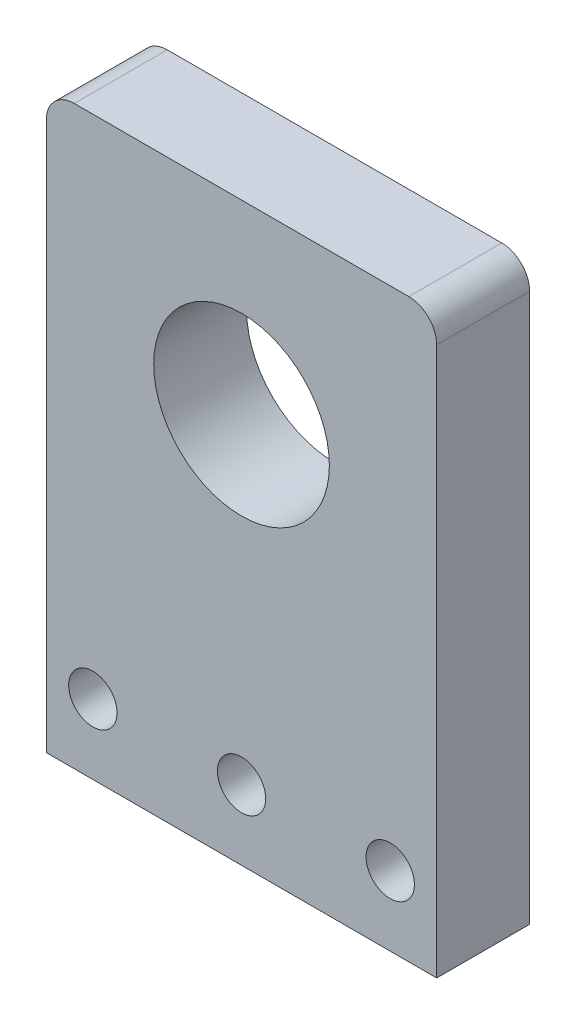
ISO-10303-21;
HEADER;
FILE_DESCRIPTION(('STEP AP214'),'2;1');
FILE_NAME('part.step','',(''),(''),'','','');
FILE_SCHEMA(('AUTOMOTIVE_DESIGN { 1 0 10303 214 1 1 1 1 }'));
ENDSEC;
DATA;
#1=APPLICATION_CONTEXT('core data for automotive mechanical design processes');
#2=APPLICATION_PROTOCOL_DEFINITION('international standard','automotive_design',2000,#1);
#3=PRODUCT_CONTEXT('',#1,'mechanical');
#4=PRODUCT('Part','Part','',(#3));
#5=PRODUCT_RELATED_PRODUCT_CATEGORY('part','',(#4));
#6=PRODUCT_DEFINITION_FORMATION('','',#4);
#7=PRODUCT_DEFINITION_CONTEXT('part definition',#1,'design');
#8=PRODUCT_DEFINITION('design','',#6,#7);
#9=PRODUCT_DEFINITION_SHAPE('','',#8);
#10=(LENGTH_UNIT() NAMED_UNIT(*) SI_UNIT(.MILLI.,.METRE.));
#11=(NAMED_UNIT(*) PLANE_ANGLE_UNIT() SI_UNIT($,.RADIAN.));
#12=(NAMED_UNIT(*) SI_UNIT($,.STERADIAN.) SOLID_ANGLE_UNIT());
#13=UNCERTAINTY_MEASURE_WITH_UNIT(LENGTH_MEASURE(1.E-05),#10,'distance_accuracy_value','');
#14=(GEOMETRIC_REPRESENTATION_CONTEXT(3) GLOBAL_UNCERTAINTY_ASSIGNED_CONTEXT((#13)) GLOBAL_UNIT_ASSIGNED_CONTEXT((#10,
#11,#12)) REPRESENTATION_CONTEXT('',''));
#15=CARTESIAN_POINT('',(0.,0.,0.));
#16=DIRECTION('',(0.,0.,1.));
#17=DIRECTION('',(1.,0.,0.));
#18=AXIS2_PLACEMENT_3D('',#15,#16,#17);
#19=CARTESIAN_POINT('',(0.,0.,10.));
#20=DIRECTION('',(0.,0.,-1.));
#21=DIRECTION('',(-1.,0.,0.));
#22=AXIS2_PLACEMENT_3D('',#19,#20,#21);
#23=PLANE('',#22);
#24=CARTESIAN_POINT('',(21.,42.,10.));
#25=DIRECTION('',(0.,0.,1.));
#26=DIRECTION('',(1.,0.,0.));
#27=AXIS2_PLACEMENT_3D('',#24,#25,#26);
#28=CIRCLE('',#27,9.45);
#29=CARTESIAN_POINT('',(30.45,42.,10.));
#30=VERTEX_POINT('',#29);
#31=EDGE_CURVE('E196',#30,#30,#28,.T.);
#32=ORIENTED_EDGE('',*,*,#31,.F.);
#33=EDGE_LOOP('',(#32));
#34=FACE_BOUND('',#33,.T.);
#35=CARTESIAN_POINT('',(4.99999999999999,7.5,10.));
#36=DIRECTION('',(0.,0.,1.));
#37=DIRECTION('',(1.,0.,0.));
#38=AXIS2_PLACEMENT_3D('',#35,#36,#37);
#39=CIRCLE('',#38,2.6);
#40=CARTESIAN_POINT('',(7.59999999999999,7.5,10.));
#41=VERTEX_POINT('',#40);
#42=EDGE_CURVE('E189',#41,#41,#39,.T.);
#43=ORIENTED_EDGE('',*,*,#42,.F.);
#44=EDGE_LOOP('',(#43));
#45=FACE_BOUND('',#44,.T.);
#46=CARTESIAN_POINT('',(21.,7.5,10.));
#47=DIRECTION('',(0.,0.,1.));
#48=DIRECTION('',(1.,0.,0.));
#49=AXIS2_PLACEMENT_3D('',#46,#47,#48);
#50=CIRCLE('',#49,2.6);
#51=CARTESIAN_POINT('',(23.6,7.5,10.));
#52=VERTEX_POINT('',#51);
#53=EDGE_CURVE('E185',#52,#52,#50,.T.);
#54=ORIENTED_EDGE('',*,*,#53,.F.);
#55=EDGE_LOOP('',(#54));
#56=FACE_BOUND('',#55,.T.);
#57=CARTESIAN_POINT('',(37.,7.5,10.));
#58=DIRECTION('',(0.,0.,1.));
#59=DIRECTION('',(1.,0.,0.));
#60=AXIS2_PLACEMENT_3D('',#57,#58,#59);
#61=CIRCLE('',#60,2.6);
#62=CARTESIAN_POINT('',(39.6,7.5,10.));
#63=VERTEX_POINT('',#62);
#64=EDGE_CURVE('E176',#63,#63,#61,.T.);
#65=ORIENTED_EDGE('',*,*,#64,.F.);
#66=EDGE_LOOP('',(#65));
#67=FACE_BOUND('',#66,.T.);
#68=DIRECTION('',(0.,1.,0.));
#69=VECTOR('',#68,1.);
#70=CARTESIAN_POINT('',(42.,0.,10.));
#71=LINE('',#70,#69);
#72=CARTESIAN_POINT('',(42.,0.,10.));
#73=VERTEX_POINT('',#72);
#74=CARTESIAN_POINT('',(42.,59.,10.));
#75=VERTEX_POINT('',#74);
#76=EDGE_CURVE('E113',#73,#75,#71,.T.);
#77=ORIENTED_EDGE('',*,*,#76,.T.);
#78=CARTESIAN_POINT('',(39.,59.,10.));
#79=DIRECTION('',(0.,0.,-1.));
#80=DIRECTION('',(-1.,0.,0.));
#81=AXIS2_PLACEMENT_3D('',#78,#79,#80);
#82=CIRCLE('',#81,3.);
#83=CARTESIAN_POINT('',(39.,62.,10.));
#84=VERTEX_POINT('',#83);
#85=EDGE_CURVE('E51',#75,#84,#82,.F.);
#86=ORIENTED_EDGE('',*,*,#85,.T.);
#87=DIRECTION('',(-1.,0.,0.));
#88=VECTOR('',#87,1.);
#89=CARTESIAN_POINT('',(0.,62.,10.));
#90=LINE('',#89,#88);
#91=CARTESIAN_POINT('',(2.99999999999999,62.,10.));
#92=VERTEX_POINT('',#91);
#93=EDGE_CURVE('E126',#84,#92,#90,.T.);
#94=ORIENTED_EDGE('',*,*,#93,.T.);
#95=CARTESIAN_POINT('',(2.99999999999999,59.,10.));
#96=DIRECTION('',(0.,0.,-1.));
#97=DIRECTION('',(-1.,0.,0.));
#98=AXIS2_PLACEMENT_3D('',#95,#96,#97);
#99=CIRCLE('',#98,3.);
#100=CARTESIAN_POINT('',(0.,59.,10.));
#101=VERTEX_POINT('',#100);
#102=EDGE_CURVE('E58',#92,#101,#99,.F.);
#103=ORIENTED_EDGE('',*,*,#102,.T.);
#104=DIRECTION('',(0.,-1.,0.));
#105=VECTOR('',#104,1.);
#106=CARTESIAN_POINT('',(0.,0.,10.));
#107=LINE('',#106,#105);
#108=CARTESIAN_POINT('',(0.,0.,10.));
#109=VERTEX_POINT('',#108);
#110=EDGE_CURVE('E96',#101,#109,#107,.T.);
#111=ORIENTED_EDGE('',*,*,#110,.T.);
#112=DIRECTION('',(1.,0.,0.));
#113=VECTOR('',#112,1.);
#114=CARTESIAN_POINT('',(0.,0.,10.));
#115=LINE('',#114,#113);
#116=EDGE_CURVE('E98',#109,#73,#115,.T.);
#117=ORIENTED_EDGE('',*,*,#116,.T.);
#118=EDGE_LOOP('',(#77,#86,#94,#103,#111,#117));
#119=FACE_BOUND('',#118,.T.);
#120=ADVANCED_FACE('F42',(#34,#45,#56,#67,#119),#23,.F.);
#121=CARTESIAN_POINT('',(0.,0.,0.));
#122=DIRECTION('',(0.,0.,-1.));
#123=DIRECTION('',(-1.,0.,0.));
#124=AXIS2_PLACEMENT_3D('',#121,#122,#123);
#125=PLANE('',#124);
#126=CARTESIAN_POINT('',(21.,42.,0.));
#127=DIRECTION('',(0.,0.,1.));
#128=DIRECTION('',(1.,0.,0.));
#129=AXIS2_PLACEMENT_3D('',#126,#127,#128);
#130=CIRCLE('',#129,9.45);
#131=CARTESIAN_POINT('',(30.45,42.,0.));
#132=VERTEX_POINT('',#131);
#133=EDGE_CURVE('E177',#132,#132,#130,.T.);
#134=ORIENTED_EDGE('',*,*,#133,.T.);
#135=EDGE_LOOP('',(#134));
#136=FACE_BOUND('',#135,.T.);
#137=CARTESIAN_POINT('',(4.99999999999999,7.5,0.));
#138=DIRECTION('',(0.,0.,1.));
#139=DIRECTION('',(1.,0.,0.));
#140=AXIS2_PLACEMENT_3D('',#137,#138,#139);
#141=CIRCLE('',#140,2.6);
#142=CARTESIAN_POINT('',(7.59999999999999,7.5,0.));
#143=VERTEX_POINT('',#142);
#144=EDGE_CURVE('E168',#143,#143,#141,.T.);
#145=ORIENTED_EDGE('',*,*,#144,.T.);
#146=EDGE_LOOP('',(#145));
#147=FACE_BOUND('',#146,.T.);
#148=CARTESIAN_POINT('',(21.,7.5,0.));
#149=DIRECTION('',(0.,0.,1.));
#150=DIRECTION('',(1.,0.,0.));
#151=AXIS2_PLACEMENT_3D('',#148,#149,#150);
#152=CIRCLE('',#151,2.6);
#153=CARTESIAN_POINT('',(23.6,7.5,0.));
#154=VERTEX_POINT('',#153);
#155=EDGE_CURVE('E181',#154,#154,#152,.T.);
#156=ORIENTED_EDGE('',*,*,#155,.T.);
#157=EDGE_LOOP('',(#156));
#158=FACE_BOUND('',#157,.T.);
#159=CARTESIAN_POINT('',(37.,7.5,0.));
#160=DIRECTION('',(0.,0.,1.));
#161=DIRECTION('',(1.,0.,0.));
#162=AXIS2_PLACEMENT_3D('',#159,#160,#161);
#163=CIRCLE('',#162,2.6);
#164=CARTESIAN_POINT('',(39.6,7.5,0.));
#165=VERTEX_POINT('',#164);
#166=EDGE_CURVE('E172',#165,#165,#163,.T.);
#167=ORIENTED_EDGE('',*,*,#166,.T.);
#168=EDGE_LOOP('',(#167));
#169=FACE_BOUND('',#168,.T.);
#170=DIRECTION('',(-1.,0.,0.));
#171=VECTOR('',#170,1.);
#172=CARTESIAN_POINT('',(0.,62.,0.));
#173=LINE('',#172,#171);
#174=CARTESIAN_POINT('',(39.,62.,0.));
#175=VERTEX_POINT('',#174);
#176=CARTESIAN_POINT('',(2.99999999999999,62.,0.));
#177=VERTEX_POINT('',#176);
#178=EDGE_CURVE('E104',#175,#177,#173,.T.);
#179=ORIENTED_EDGE('',*,*,#178,.F.);
#180=CARTESIAN_POINT('',(39.,59.,0.));
#181=DIRECTION('',(0.,0.,-1.));
#182=DIRECTION('',(-1.,0.,0.));
#183=AXIS2_PLACEMENT_3D('',#180,#181,#182);
#184=CIRCLE('',#183,3.);
#185=CARTESIAN_POINT('',(42.,59.,0.));
#186=VERTEX_POINT('',#185);
#187=EDGE_CURVE('E136',#175,#186,#184,.T.);
#188=ORIENTED_EDGE('',*,*,#187,.T.);
#189=DIRECTION('',(0.,1.,0.));
#190=VECTOR('',#189,1.);
#191=CARTESIAN_POINT('',(42.,0.,0.));
#192=LINE('',#191,#190);
#193=CARTESIAN_POINT('',(42.,0.,0.));
#194=VERTEX_POINT('',#193);
#195=EDGE_CURVE('E158',#194,#186,#192,.T.);
#196=ORIENTED_EDGE('',*,*,#195,.F.);
#197=DIRECTION('',(1.,0.,0.));
#198=VECTOR('',#197,1.);
#199=CARTESIAN_POINT('',(0.,0.,0.));
#200=LINE('',#199,#198);
#201=CARTESIAN_POINT('',(0.,0.,0.));
#202=VERTEX_POINT('',#201);
#203=EDGE_CURVE('E161',#202,#194,#200,.T.);
#204=ORIENTED_EDGE('',*,*,#203,.F.);
#205=DIRECTION('',(0.,-1.,0.));
#206=VECTOR('',#205,1.);
#207=CARTESIAN_POINT('',(0.,0.,0.));
#208=LINE('',#207,#206);
#209=CARTESIAN_POINT('',(0.,59.,0.));
#210=VERTEX_POINT('',#209);
#211=EDGE_CURVE('E117',#210,#202,#208,.T.);
#212=ORIENTED_EDGE('',*,*,#211,.F.);
#213=CARTESIAN_POINT('',(2.99999999999999,59.,0.));
#214=DIRECTION('',(0.,0.,-1.));
#215=DIRECTION('',(-1.,0.,0.));
#216=AXIS2_PLACEMENT_3D('',#213,#214,#215);
#217=CIRCLE('',#216,3.);
#218=EDGE_CURVE('E133',#210,#177,#217,.T.);
#219=ORIENTED_EDGE('',*,*,#218,.T.);
#220=EDGE_LOOP('',(#179,#188,#196,#204,#212,#219));
#221=FACE_BOUND('',#220,.T.);
#222=ADVANCED_FACE('F157',(#136,#147,#158,#169,#221),#125,.T.);
#223=CARTESIAN_POINT('',(0.,0.,10.));
#224=DIRECTION('',(1.,0.,0.));
#225=DIRECTION('',(0.,1.,0.));
#226=AXIS2_PLACEMENT_3D('',#223,#224,#225);
#227=PLANE('',#226);
#228=ORIENTED_EDGE('',*,*,#110,.F.);
#229=DIRECTION('',(0.,0.,-1.));
#230=VECTOR('',#229,1.);
#231=CARTESIAN_POINT('',(0.,59.,10.));
#232=LINE('',#231,#230);
#233=EDGE_CURVE('E11',#101,#210,#232,.T.);
#234=ORIENTED_EDGE('',*,*,#233,.T.);
#235=ORIENTED_EDGE('',*,*,#211,.T.);
#236=DIRECTION('',(0.,0.,-1.));
#237=VECTOR('',#236,1.);
#238=CARTESIAN_POINT('',(0.,0.,10.));
#239=LINE('',#238,#237);
#240=EDGE_CURVE('E109',#109,#202,#239,.T.);
#241=ORIENTED_EDGE('',*,*,#240,.F.);
#242=EDGE_LOOP('',(#228,#234,#235,#241));
#243=FACE_BOUND('',#242,.T.);
#244=ADVANCED_FACE('F115',(#243),#227,.F.);
#245=CARTESIAN_POINT('',(0.,0.,10.));
#246=DIRECTION('',(0.,1.,0.));
#247=DIRECTION('',(0.,0.,1.));
#248=AXIS2_PLACEMENT_3D('',#245,#246,#247);
#249=PLANE('',#248);
#250=ORIENTED_EDGE('',*,*,#203,.T.);
#251=DIRECTION('',(0.,0.,-1.));
#252=VECTOR('',#251,1.);
#253=CARTESIAN_POINT('',(42.,0.,10.));
#254=LINE('',#253,#252);
#255=EDGE_CURVE('E111',#73,#194,#254,.T.);
#256=ORIENTED_EDGE('',*,*,#255,.F.);
#257=ORIENTED_EDGE('',*,*,#116,.F.);
#258=ORIENTED_EDGE('',*,*,#240,.T.);
#259=EDGE_LOOP('',(#250,#256,#257,#258));
#260=FACE_BOUND('',#259,.T.);
#261=ADVANCED_FACE('F108',(#260),#249,.F.);
#262=CARTESIAN_POINT('',(42.,0.,10.));
#263=DIRECTION('',(-1.,0.,0.));
#264=DIRECTION('',(0.,-1.,0.));
#265=AXIS2_PLACEMENT_3D('',#262,#263,#264);
#266=PLANE('',#265);
#267=ORIENTED_EDGE('',*,*,#195,.T.);
#268=DIRECTION('',(0.,0.,-1.));
#269=VECTOR('',#268,1.);
#270=CARTESIAN_POINT('',(42.,59.,10.));
#271=LINE('',#270,#269);
#272=EDGE_CURVE('E66',#186,#75,#271,.F.);
#273=ORIENTED_EDGE('',*,*,#272,.T.);
#274=ORIENTED_EDGE('',*,*,#76,.F.);
#275=ORIENTED_EDGE('',*,*,#255,.T.);
#276=EDGE_LOOP('',(#267,#273,#274,#275));
#277=FACE_BOUND('',#276,.T.);
#278=ADVANCED_FACE('F159',(#277),#266,.F.);
#279=CARTESIAN_POINT('',(0.,62.,10.));
#280=DIRECTION('',(0.,-1.,0.));
#281=DIRECTION('',(0.,0.,-1.));
#282=AXIS2_PLACEMENT_3D('',#279,#280,#281);
#283=PLANE('',#282);
#284=ORIENTED_EDGE('',*,*,#93,.F.);
#285=DIRECTION('',(0.,0.,-1.));
#286=VECTOR('',#285,1.);
#287=CARTESIAN_POINT('',(39.,62.,10.));
#288=LINE('',#287,#286);
#289=EDGE_CURVE('E124',#84,#175,#288,.T.);
#290=ORIENTED_EDGE('',*,*,#289,.T.);
#291=ORIENTED_EDGE('',*,*,#178,.T.);
#292=DIRECTION('',(0.,0.,-1.));
#293=VECTOR('',#292,1.);
#294=CARTESIAN_POINT('',(2.99999999999999,62.,10.));
#295=LINE('',#294,#293);
#296=EDGE_CURVE('E120',#177,#92,#295,.F.);
#297=ORIENTED_EDGE('',*,*,#296,.T.);
#298=EDGE_LOOP('',(#284,#290,#291,#297));
#299=FACE_BOUND('',#298,.T.);
#300=ADVANCED_FACE('F148',(#299),#283,.F.);
#301=CARTESIAN_POINT('',(39.,59.,10.));
#302=DIRECTION('',(0.,0.,-1.));
#303=DIRECTION('',(-1.,0.,0.));
#304=AXIS2_PLACEMENT_3D('',#301,#302,#303);
#305=CYLINDRICAL_SURFACE('',#304,3.);
#306=ORIENTED_EDGE('',*,*,#85,.F.);
#307=ORIENTED_EDGE('',*,*,#272,.F.);
#308=ORIENTED_EDGE('',*,*,#187,.F.);
#309=ORIENTED_EDGE('',*,*,#289,.F.);
#310=EDGE_LOOP('',(#306,#307,#308,#309));
#311=FACE_BOUND('',#310,.T.);
#312=ADVANCED_FACE('F154',(#311),#305,.T.);
#313=CARTESIAN_POINT('',(2.99999999999999,59.,10.));
#314=DIRECTION('',(0.,0.,-1.));
#315=DIRECTION('',(-1.,0.,0.));
#316=AXIS2_PLACEMENT_3D('',#313,#314,#315);
#317=CYLINDRICAL_SURFACE('',#316,3.);
#318=ORIENTED_EDGE('',*,*,#102,.F.);
#319=ORIENTED_EDGE('',*,*,#296,.F.);
#320=ORIENTED_EDGE('',*,*,#218,.F.);
#321=ORIENTED_EDGE('',*,*,#233,.F.);
#322=EDGE_LOOP('',(#318,#319,#320,#321));
#323=FACE_BOUND('',#322,.T.);
#324=ADVANCED_FACE('F44',(#323),#317,.T.);
#325=CARTESIAN_POINT('',(37.,7.5,0.));
#326=DIRECTION('',(0.,0.,1.));
#327=DIRECTION('',(1.,0.,0.));
#328=AXIS2_PLACEMENT_3D('',#325,#326,#327);
#329=CYLINDRICAL_SURFACE('',#328,2.6);
#330=ORIENTED_EDGE('',*,*,#166,.F.);
#331=EDGE_LOOP('',(#330));
#332=FACE_BOUND('',#331,.T.);
#333=ORIENTED_EDGE('',*,*,#64,.T.);
#334=EDGE_LOOP('',(#333));
#335=FACE_BOUND('',#334,.T.);
#336=ADVANCED_FACE('F222',(#332,#335),#329,.F.);
#337=CARTESIAN_POINT('',(21.,7.5,0.));
#338=DIRECTION('',(0.,0.,1.));
#339=DIRECTION('',(1.,0.,0.));
#340=AXIS2_PLACEMENT_3D('',#337,#338,#339);
#341=CYLINDRICAL_SURFACE('',#340,2.6);
#342=ORIENTED_EDGE('',*,*,#155,.F.);
#343=EDGE_LOOP('',(#342));
#344=FACE_BOUND('',#343,.T.);
#345=ORIENTED_EDGE('',*,*,#53,.T.);
#346=EDGE_LOOP('',(#345));
#347=FACE_BOUND('',#346,.T.);
#348=ADVANCED_FACE('F224',(#344,#347),#341,.F.);
#349=CARTESIAN_POINT('',(4.99999999999999,7.5,0.));
#350=DIRECTION('',(0.,0.,1.));
#351=DIRECTION('',(1.,0.,0.));
#352=AXIS2_PLACEMENT_3D('',#349,#350,#351);
#353=CYLINDRICAL_SURFACE('',#352,2.6);
#354=ORIENTED_EDGE('',*,*,#144,.F.);
#355=EDGE_LOOP('',(#354));
#356=FACE_BOUND('',#355,.T.);
#357=ORIENTED_EDGE('',*,*,#42,.T.);
#358=EDGE_LOOP('',(#357));
#359=FACE_BOUND('',#358,.T.);
#360=ADVANCED_FACE('F209',(#356,#359),#353,.F.);
#361=CARTESIAN_POINT('',(21.,42.,0.));
#362=DIRECTION('',(0.,0.,1.));
#363=DIRECTION('',(1.,0.,0.));
#364=AXIS2_PLACEMENT_3D('',#361,#362,#363);
#365=CYLINDRICAL_SURFACE('',#364,9.45);
#366=ORIENTED_EDGE('',*,*,#133,.F.);
#367=EDGE_LOOP('',(#366));
#368=FACE_BOUND('',#367,.T.);
#369=ORIENTED_EDGE('',*,*,#31,.T.);
#370=EDGE_LOOP('',(#369));
#371=FACE_BOUND('',#370,.T.);
#372=ADVANCED_FACE('F206',(#368,#371),#365,.F.);
#373=CLOSED_SHELL('',(#120,#222,#244,#261,#278,#300,#312,#324,#336,#348,#360,#372));
#374=MANIFOLD_SOLID_BREP('B2',#373);
#375=ADVANCED_BREP_SHAPE_REPRESENTATION('',(#18,#374),#14);
#376=SHAPE_DEFINITION_REPRESENTATION(#9,#375);
ENDSEC;
END-ISO-10303-21;
